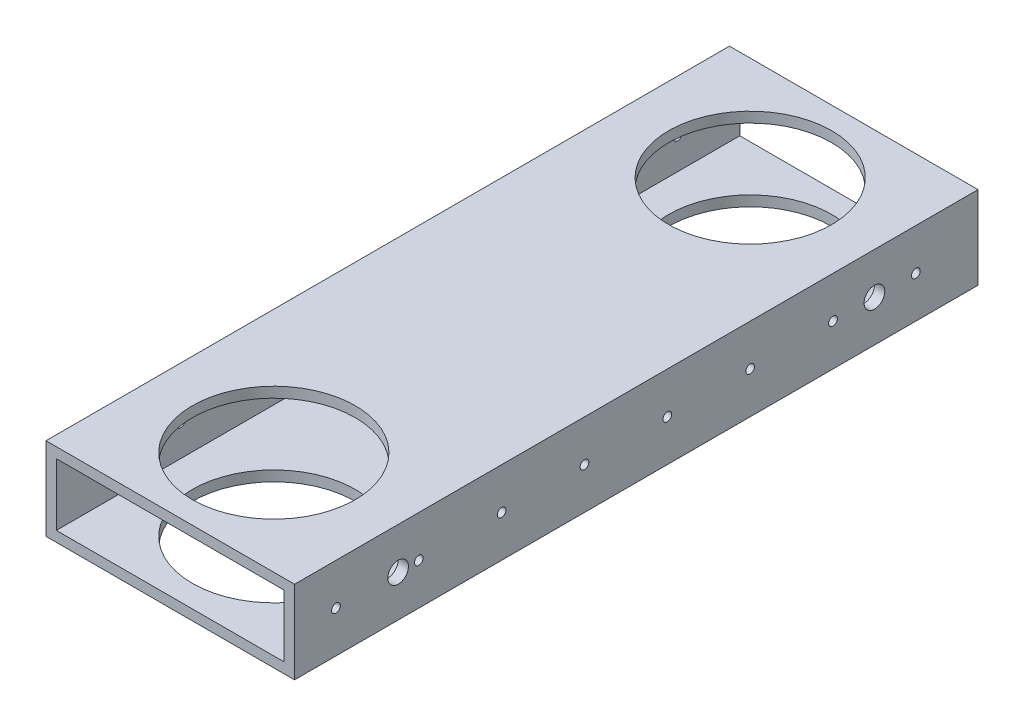
ISO-10303-21;
HEADER;
FILE_DESCRIPTION(('STEP AP214'),'2;1');
FILE_NAME('part.step','',(''),(''),'','','');
FILE_SCHEMA(('AUTOMOTIVE_DESIGN { 1 0 10303 214 1 1 1 1 }'));
ENDSEC;
DATA;
#1=APPLICATION_CONTEXT('core data for automotive mechanical design processes');
#2=APPLICATION_PROTOCOL_DEFINITION('international standard','automotive_design',2000,#1);
#3=PRODUCT_CONTEXT('',#1,'mechanical');
#4=PRODUCT('Part','Part','',(#3));
#5=PRODUCT_RELATED_PRODUCT_CATEGORY('part','',(#4));
#6=PRODUCT_DEFINITION_FORMATION('','',#4);
#7=PRODUCT_DEFINITION_CONTEXT('part definition',#1,'design');
#8=PRODUCT_DEFINITION('design','',#6,#7);
#9=PRODUCT_DEFINITION_SHAPE('','',#8);
#10=(LENGTH_UNIT() NAMED_UNIT(*) SI_UNIT(.MILLI.,.METRE.));
#11=(NAMED_UNIT(*) PLANE_ANGLE_UNIT() SI_UNIT($,.RADIAN.));
#12=(NAMED_UNIT(*) SI_UNIT($,.STERADIAN.) SOLID_ANGLE_UNIT());
#13=UNCERTAINTY_MEASURE_WITH_UNIT(LENGTH_MEASURE(1.E-05),#10,'distance_accuracy_value','');
#14=(GEOMETRIC_REPRESENTATION_CONTEXT(3) GLOBAL_UNCERTAINTY_ASSIGNED_CONTEXT((#13)) GLOBAL_UNIT_ASSIGNED_CONTEXT((#10,
#11,#12)) REPRESENTATION_CONTEXT('',''));
#15=CARTESIAN_POINT('',(0.,0.,0.));
#16=DIRECTION('',(0.,0.,1.));
#17=DIRECTION('',(1.,0.,0.));
#18=AXIS2_PLACEMENT_3D('',#15,#16,#17);
#19=CARTESIAN_POINT('',(0.,0.,209.55));
#20=DIRECTION('',(0.,0.,1.));
#21=DIRECTION('',(1.,0.,0.));
#22=AXIS2_PLACEMENT_3D('',#19,#20,#21);
#23=PLANE('',#22);
#24=DIRECTION('',(0.,1.,0.));
#25=VECTOR('',#24,1.);
#26=CARTESIAN_POINT('',(38.1,-12.7,209.55));
#27=LINE('',#26,#25);
#28=CARTESIAN_POINT('',(38.1,-12.7,209.55));
#29=VERTEX_POINT('',#28);
#30=CARTESIAN_POINT('',(38.1,12.7,209.55));
#31=VERTEX_POINT('',#30);
#32=EDGE_CURVE('E168',#29,#31,#27,.T.);
#33=ORIENTED_EDGE('',*,*,#32,.T.);
#34=DIRECTION('',(-1.,0.,0.));
#35=VECTOR('',#34,1.);
#36=CARTESIAN_POINT('',(-38.1,12.7,209.55));
#37=LINE('',#36,#35);
#38=CARTESIAN_POINT('',(-38.1,12.7,209.55));
#39=VERTEX_POINT('',#38);
#40=EDGE_CURVE('E171',#31,#39,#37,.T.);
#41=ORIENTED_EDGE('',*,*,#40,.T.);
#42=DIRECTION('',(0.,-1.,0.));
#43=VECTOR('',#42,1.);
#44=CARTESIAN_POINT('',(-38.1,-12.7,209.55));
#45=LINE('',#44,#43);
#46=CARTESIAN_POINT('',(-38.1,-12.7,209.55));
#47=VERTEX_POINT('',#46);
#48=EDGE_CURVE('E174',#39,#47,#45,.T.);
#49=ORIENTED_EDGE('',*,*,#48,.T.);
#50=DIRECTION('',(1.,0.,0.));
#51=VECTOR('',#50,1.);
#52=CARTESIAN_POINT('',(-38.1,-12.7,209.55));
#53=LINE('',#52,#51);
#54=EDGE_CURVE('E176',#47,#29,#53,.T.);
#55=ORIENTED_EDGE('',*,*,#54,.T.);
#56=EDGE_LOOP('',(#33,#41,#49,#55));
#57=FACE_BOUND('',#56,.T.);
#58=DIRECTION('',(-1.,0.,0.));
#59=VECTOR('',#58,1.);
#60=CARTESIAN_POINT('',(0.,9.525,209.55));
#61=LINE('',#60,#59);
#62=CARTESIAN_POINT('',(34.925,9.525,209.55));
#63=VERTEX_POINT('',#62);
#64=CARTESIAN_POINT('',(-34.925,9.525,209.55));
#65=VERTEX_POINT('',#64);
#66=EDGE_CURVE('E138',#63,#65,#61,.T.);
#67=ORIENTED_EDGE('',*,*,#66,.F.);
#68=DIRECTION('',(0.,1.,0.));
#69=VECTOR('',#68,1.);
#70=CARTESIAN_POINT('',(34.925,0.,209.55));
#71=LINE('',#70,#69);
#72=CARTESIAN_POINT('',(34.925,-9.525,209.55));
#73=VERTEX_POINT('',#72);
#74=EDGE_CURVE('E130',#73,#63,#71,.T.);
#75=ORIENTED_EDGE('',*,*,#74,.F.);
#76=DIRECTION('',(1.,0.,0.));
#77=VECTOR('',#76,1.);
#78=CARTESIAN_POINT('',(0.,-9.525,209.55));
#79=LINE('',#78,#77);
#80=CARTESIAN_POINT('',(-34.925,-9.525,209.55));
#81=VERTEX_POINT('',#80);
#82=EDGE_CURVE('E152',#81,#73,#79,.T.);
#83=ORIENTED_EDGE('',*,*,#82,.F.);
#84=DIRECTION('',(0.,-1.,0.));
#85=VECTOR('',#84,1.);
#86=CARTESIAN_POINT('',(-34.925,0.,209.55));
#87=LINE('',#86,#85);
#88=EDGE_CURVE('E150',#65,#81,#87,.T.);
#89=ORIENTED_EDGE('',*,*,#88,.F.);
#90=EDGE_LOOP('',(#67,#75,#83,#89));
#91=FACE_BOUND('',#90,.T.);
#92=ADVANCED_FACE('F63',(#57,#91),#23,.T.);
#93=CARTESIAN_POINT('',(0.,0.,0.));
#94=DIRECTION('',(0.,0.,1.));
#95=DIRECTION('',(1.,0.,0.));
#96=AXIS2_PLACEMENT_3D('',#93,#94,#95);
#97=PLANE('',#96);
#98=DIRECTION('',(0.,1.,0.));
#99=VECTOR('',#98,1.);
#100=CARTESIAN_POINT('',(38.1,-12.7,0.));
#101=LINE('',#100,#99);
#102=CARTESIAN_POINT('',(38.1,-12.7,0.));
#103=VERTEX_POINT('',#102);
#104=CARTESIAN_POINT('',(38.1,12.7,0.));
#105=VERTEX_POINT('',#104);
#106=EDGE_CURVE('E146',#103,#105,#101,.T.);
#107=ORIENTED_EDGE('',*,*,#106,.F.);
#108=DIRECTION('',(1.,0.,0.));
#109=VECTOR('',#108,1.);
#110=CARTESIAN_POINT('',(-38.1,-12.7,0.));
#111=LINE('',#110,#109);
#112=CARTESIAN_POINT('',(-38.1,-12.7,0.));
#113=VERTEX_POINT('',#112);
#114=EDGE_CURVE('E172',#113,#103,#111,.T.);
#115=ORIENTED_EDGE('',*,*,#114,.F.);
#116=DIRECTION('',(0.,-1.,0.));
#117=VECTOR('',#116,1.);
#118=CARTESIAN_POINT('',(-38.1,-12.7,0.));
#119=LINE('',#118,#117);
#120=CARTESIAN_POINT('',(-38.1,12.7,0.));
#121=VERTEX_POINT('',#120);
#122=EDGE_CURVE('E183',#121,#113,#119,.T.);
#123=ORIENTED_EDGE('',*,*,#122,.F.);
#124=DIRECTION('',(-1.,0.,0.));
#125=VECTOR('',#124,1.);
#126=CARTESIAN_POINT('',(-38.1,12.7,0.));
#127=LINE('',#126,#125);
#128=EDGE_CURVE('E181',#105,#121,#127,.T.);
#129=ORIENTED_EDGE('',*,*,#128,.F.);
#130=EDGE_LOOP('',(#107,#115,#123,#129));
#131=FACE_BOUND('',#130,.T.);
#132=DIRECTION('',(0.,1.,0.));
#133=VECTOR('',#132,1.);
#134=CARTESIAN_POINT('',(34.925,0.,0.));
#135=LINE('',#134,#133);
#136=CARTESIAN_POINT('',(34.925,-9.525,0.));
#137=VERTEX_POINT('',#136);
#138=CARTESIAN_POINT('',(34.925,9.525,0.));
#139=VERTEX_POINT('',#138);
#140=EDGE_CURVE('E88',#137,#139,#135,.T.);
#141=ORIENTED_EDGE('',*,*,#140,.T.);
#142=DIRECTION('',(-1.,0.,0.));
#143=VECTOR('',#142,1.);
#144=CARTESIAN_POINT('',(0.,9.525,0.));
#145=LINE('',#144,#143);
#146=CARTESIAN_POINT('',(-34.925,9.525,0.));
#147=VERTEX_POINT('',#146);
#148=EDGE_CURVE('E145',#139,#147,#145,.T.);
#149=ORIENTED_EDGE('',*,*,#148,.T.);
#150=DIRECTION('',(0.,-1.,0.));
#151=VECTOR('',#150,1.);
#152=CARTESIAN_POINT('',(-34.925,0.,0.));
#153=LINE('',#152,#151);
#154=CARTESIAN_POINT('',(-34.925,-9.525,0.));
#155=VERTEX_POINT('',#154);
#156=EDGE_CURVE('E160',#147,#155,#153,.T.);
#157=ORIENTED_EDGE('',*,*,#156,.T.);
#158=DIRECTION('',(1.,0.,0.));
#159=VECTOR('',#158,1.);
#160=CARTESIAN_POINT('',(0.,-9.525,0.));
#161=LINE('',#160,#159);
#162=EDGE_CURVE('E139',#155,#137,#161,.T.);
#163=ORIENTED_EDGE('',*,*,#162,.T.);
#164=EDGE_LOOP('',(#141,#149,#157,#163));
#165=FACE_BOUND('',#164,.T.);
#166=ADVANCED_FACE('F367',(#131,#165),#97,.F.);
#167=CARTESIAN_POINT('',(38.1,-12.7,209.55));
#168=DIRECTION('',(-1.,0.,0.));
#169=DIRECTION('',(0.,0.,1.));
#170=AXIS2_PLACEMENT_3D('',#167,#168,#169);
#171=PLANE('',#170);
#172=CARTESIAN_POINT('',(38.1,0.,31.75));
#173=DIRECTION('',(1.,0.,0.));
#174=DIRECTION('',(0.,0.,-1.));
#175=AXIS2_PLACEMENT_3D('',#172,#173,#174);
#176=CIRCLE('',#175,3.175);
#177=CARTESIAN_POINT('',(38.1,0.,28.575));
#178=VERTEX_POINT('',#177);
#179=EDGE_CURVE('E243',#178,#178,#176,.T.);
#180=ORIENTED_EDGE('',*,*,#179,.F.);
#181=EDGE_LOOP('',(#180));
#182=FACE_BOUND('',#181,.T.);
#183=CARTESIAN_POINT('',(38.1,0.,177.8));
#184=DIRECTION('',(1.,0.,0.));
#185=DIRECTION('',(0.,0.,1.));
#186=AXIS2_PLACEMENT_3D('',#183,#184,#185);
#187=CIRCLE('',#186,3.175);
#188=CARTESIAN_POINT('',(38.1,0.,180.975));
#189=VERTEX_POINT('',#188);
#190=EDGE_CURVE('E253',#189,#189,#187,.T.);
#191=ORIENTED_EDGE('',*,*,#190,.F.);
#192=EDGE_LOOP('',(#191));
#193=FACE_BOUND('',#192,.T.);
#194=CARTESIAN_POINT('',(38.1,0.,171.45));
#195=DIRECTION('',(1.,0.,0.));
#196=DIRECTION('',(0.,0.,-1.));
#197=AXIS2_PLACEMENT_3D('',#194,#195,#196);
#198=CIRCLE('',#197,1.33349999999998);
#199=CARTESIAN_POINT('',(38.1,0.,170.1165));
#200=VERTEX_POINT('',#199);
#201=EDGE_CURVE('E262',#200,#200,#198,.T.);
#202=ORIENTED_EDGE('',*,*,#201,.F.);
#203=EDGE_LOOP('',(#202));
#204=FACE_BOUND('',#203,.T.);
#205=CARTESIAN_POINT('',(38.1,0.,146.05));
#206=DIRECTION('',(1.,0.,0.));
#207=DIRECTION('',(0.,0.,-1.));
#208=AXIS2_PLACEMENT_3D('',#205,#206,#207);
#209=CIRCLE('',#208,1.33349999999998);
#210=CARTESIAN_POINT('',(38.1,0.,144.7165));
#211=VERTEX_POINT('',#210);
#212=EDGE_CURVE('E268',#211,#211,#209,.T.);
#213=ORIENTED_EDGE('',*,*,#212,.F.);
#214=EDGE_LOOP('',(#213));
#215=FACE_BOUND('',#214,.T.);
#216=CARTESIAN_POINT('',(38.1,0.,120.65));
#217=DIRECTION('',(1.,0.,0.));
#218=DIRECTION('',(0.,0.,-1.));
#219=AXIS2_PLACEMENT_3D('',#216,#217,#218);
#220=CIRCLE('',#219,1.33349999999998);
#221=CARTESIAN_POINT('',(38.1,0.,119.3165));
#222=VERTEX_POINT('',#221);
#223=EDGE_CURVE('E274',#222,#222,#220,.T.);
#224=ORIENTED_EDGE('',*,*,#223,.F.);
#225=EDGE_LOOP('',(#224));
#226=FACE_BOUND('',#225,.T.);
#227=CARTESIAN_POINT('',(38.1,0.,95.25));
#228=DIRECTION('',(1.,0.,0.));
#229=DIRECTION('',(0.,0.,-1.));
#230=AXIS2_PLACEMENT_3D('',#227,#228,#229);
#231=CIRCLE('',#230,1.33349999999998);
#232=CARTESIAN_POINT('',(38.1,0.,93.9165));
#233=VERTEX_POINT('',#232);
#234=EDGE_CURVE('E280',#233,#233,#231,.T.);
#235=ORIENTED_EDGE('',*,*,#234,.F.);
#236=EDGE_LOOP('',(#235));
#237=FACE_BOUND('',#236,.T.);
#238=CARTESIAN_POINT('',(38.1,0.,69.85));
#239=DIRECTION('',(1.,0.,0.));
#240=DIRECTION('',(0.,0.,-1.));
#241=AXIS2_PLACEMENT_3D('',#238,#239,#240);
#242=CIRCLE('',#241,1.33349999999998);
#243=CARTESIAN_POINT('',(38.1,0.,68.5165));
#244=VERTEX_POINT('',#243);
#245=EDGE_CURVE('E286',#244,#244,#242,.T.);
#246=ORIENTED_EDGE('',*,*,#245,.F.);
#247=EDGE_LOOP('',(#246));
#248=FACE_BOUND('',#247,.T.);
#249=CARTESIAN_POINT('',(38.1,0.,44.45));
#250=DIRECTION('',(1.,0.,0.));
#251=DIRECTION('',(0.,0.,-1.));
#252=AXIS2_PLACEMENT_3D('',#249,#250,#251);
#253=CIRCLE('',#252,1.33349999999998);
#254=CARTESIAN_POINT('',(38.1,0.,43.1165));
#255=VERTEX_POINT('',#254);
#256=EDGE_CURVE('E292',#255,#255,#253,.T.);
#257=ORIENTED_EDGE('',*,*,#256,.F.);
#258=EDGE_LOOP('',(#257));
#259=FACE_BOUND('',#258,.T.);
#260=CARTESIAN_POINT('',(38.1,0.,19.05));
#261=DIRECTION('',(1.,0.,0.));
#262=DIRECTION('',(0.,0.,-1.));
#263=AXIS2_PLACEMENT_3D('',#260,#261,#262);
#264=CIRCLE('',#263,1.33349999999998);
#265=CARTESIAN_POINT('',(38.1,0.,17.7165));
#266=VERTEX_POINT('',#265);
#267=EDGE_CURVE('E259',#266,#266,#264,.T.);
#268=ORIENTED_EDGE('',*,*,#267,.F.);
#269=EDGE_LOOP('',(#268));
#270=FACE_BOUND('',#269,.T.);
#271=CARTESIAN_POINT('',(38.1,0.,196.85));
#272=DIRECTION('',(1.,0.,0.));
#273=DIRECTION('',(0.,0.,-1.));
#274=AXIS2_PLACEMENT_3D('',#271,#272,#273);
#275=CIRCLE('',#274,1.33349999999998);
#276=CARTESIAN_POINT('',(38.1,0.,195.5165));
#277=VERTEX_POINT('',#276);
#278=EDGE_CURVE('E314',#277,#277,#275,.T.);
#279=ORIENTED_EDGE('',*,*,#278,.F.);
#280=EDGE_LOOP('',(#279));
#281=FACE_BOUND('',#280,.T.);
#282=ORIENTED_EDGE('',*,*,#106,.T.);
#283=DIRECTION('',(0.,0.,-1.));
#284=VECTOR('',#283,1.);
#285=CARTESIAN_POINT('',(38.1,12.7,209.55));
#286=LINE('',#285,#284);
#287=EDGE_CURVE('E12',#31,#105,#286,.T.);
#288=ORIENTED_EDGE('',*,*,#287,.F.);
#289=ORIENTED_EDGE('',*,*,#32,.F.);
#290=DIRECTION('',(0.,0.,-1.));
#291=VECTOR('',#290,1.);
#292=CARTESIAN_POINT('',(38.1,-12.7,209.55));
#293=LINE('',#292,#291);
#294=EDGE_CURVE('E178',#29,#103,#293,.T.);
#295=ORIENTED_EDGE('',*,*,#294,.T.);
#296=EDGE_LOOP('',(#282,#288,#289,#295));
#297=FACE_BOUND('',#296,.T.);
#298=ADVANCED_FACE('F65',(#182,#193,#204,#215,#226,#237,#248,#259,#270,#281,#297),#171,.F.);
#299=CARTESIAN_POINT('',(-38.1,12.7,209.55));
#300=DIRECTION('',(0.,-1.,0.));
#301=DIRECTION('',(0.,0.,-1.));
#302=AXIS2_PLACEMENT_3D('',#299,#300,#301);
#303=PLANE('',#302);
#304=CARTESIAN_POINT('',(0.,12.7,177.8));
#305=DIRECTION('',(0.,1.,0.));
#306=DIRECTION('',(0.,0.,1.));
#307=AXIS2_PLACEMENT_3D('',#304,#305,#306);
#308=CIRCLE('',#307,24.97201);
#309=CARTESIAN_POINT('',(0.,12.7,202.77201));
#310=VERTEX_POINT('',#309);
#311=EDGE_CURVE('E324',#310,#310,#308,.T.);
#312=ORIENTED_EDGE('',*,*,#311,.F.);
#313=EDGE_LOOP('',(#312));
#314=FACE_BOUND('',#313,.T.);
#315=CARTESIAN_POINT('',(0.,12.7,31.75));
#316=DIRECTION('',(0.,1.,0.));
#317=DIRECTION('',(0.,0.,-1.));
#318=AXIS2_PLACEMENT_3D('',#315,#316,#317);
#319=CIRCLE('',#318,24.97201);
#320=CARTESIAN_POINT('',(0.,12.7,6.77799));
#321=VERTEX_POINT('',#320);
#322=EDGE_CURVE('E321',#321,#321,#319,.T.);
#323=ORIENTED_EDGE('',*,*,#322,.F.);
#324=EDGE_LOOP('',(#323));
#325=FACE_BOUND('',#324,.T.);
#326=ORIENTED_EDGE('',*,*,#128,.T.);
#327=DIRECTION('',(0.,0.,-1.));
#328=VECTOR('',#327,1.);
#329=CARTESIAN_POINT('',(-38.1,12.7,209.55));
#330=LINE('',#329,#328);
#331=EDGE_CURVE('E72',#39,#121,#330,.T.);
#332=ORIENTED_EDGE('',*,*,#331,.F.);
#333=ORIENTED_EDGE('',*,*,#40,.F.);
#334=ORIENTED_EDGE('',*,*,#287,.T.);
#335=EDGE_LOOP('',(#326,#332,#333,#334));
#336=FACE_BOUND('',#335,.T.);
#337=ADVANCED_FACE('F353',(#314,#325,#336),#303,.F.);
#338=CARTESIAN_POINT('',(-38.1,-12.7,209.55));
#339=DIRECTION('',(1.,0.,0.));
#340=DIRECTION('',(0.,0.,-1.));
#341=AXIS2_PLACEMENT_3D('',#338,#339,#340);
#342=PLANE('',#341);
#343=CARTESIAN_POINT('',(-38.1,0.,31.75));
#344=DIRECTION('',(1.,0.,0.));
#345=DIRECTION('',(0.,0.,-1.));
#346=AXIS2_PLACEMENT_3D('',#343,#344,#345);
#347=CIRCLE('',#346,3.175);
#348=CARTESIAN_POINT('',(-38.1,0.,28.575));
#349=VERTEX_POINT('',#348);
#350=EDGE_CURVE('E237',#349,#349,#347,.T.);
#351=ORIENTED_EDGE('',*,*,#350,.T.);
#352=EDGE_LOOP('',(#351));
#353=FACE_BOUND('',#352,.T.);
#354=CARTESIAN_POINT('',(-38.1,0.,177.8));
#355=DIRECTION('',(1.,0.,0.));
#356=DIRECTION('',(0.,0.,1.));
#357=AXIS2_PLACEMENT_3D('',#354,#355,#356);
#358=CIRCLE('',#357,3.175);
#359=CARTESIAN_POINT('',(-38.1,0.,180.975));
#360=VERTEX_POINT('',#359);
#361=EDGE_CURVE('E248',#360,#360,#358,.T.);
#362=ORIENTED_EDGE('',*,*,#361,.T.);
#363=EDGE_LOOP('',(#362));
#364=FACE_BOUND('',#363,.T.);
#365=CARTESIAN_POINT('',(-38.1,0.,171.45));
#366=DIRECTION('',(1.,0.,0.));
#367=DIRECTION('',(0.,0.,-1.));
#368=AXIS2_PLACEMENT_3D('',#365,#366,#367);
#369=CIRCLE('',#368,1.33349999999998);
#370=CARTESIAN_POINT('',(-38.1,0.,170.1165));
#371=VERTEX_POINT('',#370);
#372=EDGE_CURVE('E210',#371,#371,#369,.T.);
#373=ORIENTED_EDGE('',*,*,#372,.T.);
#374=EDGE_LOOP('',(#373));
#375=FACE_BOUND('',#374,.T.);
#376=CARTESIAN_POINT('',(-38.1,0.,146.05));
#377=DIRECTION('',(1.,0.,0.));
#378=DIRECTION('',(0.,0.,-1.));
#379=AXIS2_PLACEMENT_3D('',#376,#377,#378);
#380=CIRCLE('',#379,1.33349999999998);
#381=CARTESIAN_POINT('',(-38.1,0.,144.7165));
#382=VERTEX_POINT('',#381);
#383=EDGE_CURVE('E265',#382,#382,#380,.T.);
#384=ORIENTED_EDGE('',*,*,#383,.T.);
#385=EDGE_LOOP('',(#384));
#386=FACE_BOUND('',#385,.T.);
#387=CARTESIAN_POINT('',(-38.1,0.,120.65));
#388=DIRECTION('',(1.,0.,0.));
#389=DIRECTION('',(0.,0.,-1.));
#390=AXIS2_PLACEMENT_3D('',#387,#388,#389);
#391=CIRCLE('',#390,1.33349999999998);
#392=CARTESIAN_POINT('',(-38.1,0.,119.3165));
#393=VERTEX_POINT('',#392);
#394=EDGE_CURVE('E271',#393,#393,#391,.T.);
#395=ORIENTED_EDGE('',*,*,#394,.T.);
#396=EDGE_LOOP('',(#395));
#397=FACE_BOUND('',#396,.T.);
#398=CARTESIAN_POINT('',(-38.1,0.,95.25));
#399=DIRECTION('',(1.,0.,0.));
#400=DIRECTION('',(0.,0.,-1.));
#401=AXIS2_PLACEMENT_3D('',#398,#399,#400);
#402=CIRCLE('',#401,1.33349999999998);
#403=CARTESIAN_POINT('',(-38.1,0.,93.9165));
#404=VERTEX_POINT('',#403);
#405=EDGE_CURVE('E277',#404,#404,#402,.T.);
#406=ORIENTED_EDGE('',*,*,#405,.T.);
#407=EDGE_LOOP('',(#406));
#408=FACE_BOUND('',#407,.T.);
#409=CARTESIAN_POINT('',(-38.1,0.,69.85));
#410=DIRECTION('',(1.,0.,0.));
#411=DIRECTION('',(0.,0.,-1.));
#412=AXIS2_PLACEMENT_3D('',#409,#410,#411);
#413=CIRCLE('',#412,1.33349999999998);
#414=CARTESIAN_POINT('',(-38.1,0.,68.5165));
#415=VERTEX_POINT('',#414);
#416=EDGE_CURVE('E283',#415,#415,#413,.T.);
#417=ORIENTED_EDGE('',*,*,#416,.T.);
#418=EDGE_LOOP('',(#417));
#419=FACE_BOUND('',#418,.T.);
#420=CARTESIAN_POINT('',(-38.1,0.,44.45));
#421=DIRECTION('',(1.,0.,0.));
#422=DIRECTION('',(0.,0.,-1.));
#423=AXIS2_PLACEMENT_3D('',#420,#421,#422);
#424=CIRCLE('',#423,1.33349999999998);
#425=CARTESIAN_POINT('',(-38.1,0.,43.1165));
#426=VERTEX_POINT('',#425);
#427=EDGE_CURVE('E289',#426,#426,#424,.T.);
#428=ORIENTED_EDGE('',*,*,#427,.T.);
#429=EDGE_LOOP('',(#428));
#430=FACE_BOUND('',#429,.T.);
#431=CARTESIAN_POINT('',(-38.1,0.,19.05));
#432=DIRECTION('',(1.,0.,0.));
#433=DIRECTION('',(0.,0.,-1.));
#434=AXIS2_PLACEMENT_3D('',#431,#432,#433);
#435=CIRCLE('',#434,1.33349999999998);
#436=CARTESIAN_POINT('',(-38.1,0.,17.7165));
#437=VERTEX_POINT('',#436);
#438=EDGE_CURVE('E295',#437,#437,#435,.T.);
#439=ORIENTED_EDGE('',*,*,#438,.T.);
#440=EDGE_LOOP('',(#439));
#441=FACE_BOUND('',#440,.T.);
#442=CARTESIAN_POINT('',(-38.1,0.,196.85));
#443=DIRECTION('',(1.,0.,0.));
#444=DIRECTION('',(0.,0.,-1.));
#445=AXIS2_PLACEMENT_3D('',#442,#443,#444);
#446=CIRCLE('',#445,1.33349999999998);
#447=CARTESIAN_POINT('',(-38.1,0.,195.5165));
#448=VERTEX_POINT('',#447);
#449=EDGE_CURVE('E205',#448,#448,#446,.T.);
#450=ORIENTED_EDGE('',*,*,#449,.T.);
#451=EDGE_LOOP('',(#450));
#452=FACE_BOUND('',#451,.T.);
#453=ORIENTED_EDGE('',*,*,#122,.T.);
#454=DIRECTION('',(0.,0.,-1.));
#455=VECTOR('',#454,1.);
#456=CARTESIAN_POINT('',(-38.1,-12.7,209.55));
#457=LINE('',#456,#455);
#458=EDGE_CURVE('E188',#47,#113,#457,.T.);
#459=ORIENTED_EDGE('',*,*,#458,.F.);
#460=ORIENTED_EDGE('',*,*,#48,.F.);
#461=ORIENTED_EDGE('',*,*,#331,.T.);
#462=EDGE_LOOP('',(#453,#459,#460,#461));
#463=FACE_BOUND('',#462,.T.);
#464=ADVANCED_FACE('F356',(#353,#364,#375,#386,#397,#408,#419,#430,#441,#452,#463),#342,.F.);
#465=CARTESIAN_POINT('',(-38.1,-12.7,209.55));
#466=DIRECTION('',(0.,1.,0.));
#467=DIRECTION('',(0.,0.,1.));
#468=AXIS2_PLACEMENT_3D('',#465,#466,#467);
#469=PLANE('',#468);
#470=CARTESIAN_POINT('',(0.,-12.7,177.8));
#471=DIRECTION('',(0.,1.,0.));
#472=DIRECTION('',(0.,0.,1.));
#473=AXIS2_PLACEMENT_3D('',#470,#471,#472);
#474=CIRCLE('',#473,24.97201);
#475=CARTESIAN_POINT('',(0.,-12.7,202.77201));
#476=VERTEX_POINT('',#475);
#477=EDGE_CURVE('E197',#476,#476,#474,.T.);
#478=ORIENTED_EDGE('',*,*,#477,.T.);
#479=EDGE_LOOP('',(#478));
#480=FACE_BOUND('',#479,.T.);
#481=CARTESIAN_POINT('',(0.,-12.7,31.75));
#482=DIRECTION('',(0.,1.,0.));
#483=DIRECTION('',(0.,0.,-1.));
#484=AXIS2_PLACEMENT_3D('',#481,#482,#483);
#485=CIRCLE('',#484,24.97201);
#486=CARTESIAN_POINT('',(0.,-12.7,6.77799));
#487=VERTEX_POINT('',#486);
#488=EDGE_CURVE('E327',#487,#487,#485,.T.);
#489=ORIENTED_EDGE('',*,*,#488,.T.);
#490=EDGE_LOOP('',(#489));
#491=FACE_BOUND('',#490,.T.);
#492=ORIENTED_EDGE('',*,*,#114,.T.);
#493=ORIENTED_EDGE('',*,*,#294,.F.);
#494=ORIENTED_EDGE('',*,*,#54,.F.);
#495=ORIENTED_EDGE('',*,*,#458,.T.);
#496=EDGE_LOOP('',(#492,#493,#494,#495));
#497=FACE_BOUND('',#496,.T.);
#498=ADVANCED_FACE('F371',(#480,#491,#497),#469,.F.);
#499=CARTESIAN_POINT('',(34.925,0.,209.55));
#500=DIRECTION('',(-1.,0.,0.));
#501=DIRECTION('',(0.,0.,1.));
#502=AXIS2_PLACEMENT_3D('',#499,#500,#501);
#503=PLANE('',#502);
#504=CARTESIAN_POINT('',(34.925,0.,31.75));
#505=DIRECTION('',(-1.,0.,0.));
#506=DIRECTION('',(0.,0.,1.));
#507=AXIS2_PLACEMENT_3D('',#504,#505,#506);
#508=CIRCLE('',#507,3.175);
#509=CARTESIAN_POINT('',(34.925,0.,34.925));
#510=VERTEX_POINT('',#509);
#511=EDGE_CURVE('E256',#510,#510,#508,.T.);
#512=ORIENTED_EDGE('',*,*,#511,.F.);
#513=EDGE_LOOP('',(#512));
#514=FACE_BOUND('',#513,.T.);
#515=CARTESIAN_POINT('',(34.925,0.,177.8));
#516=DIRECTION('',(-1.,0.,0.));
#517=DIRECTION('',(0.,0.,1.));
#518=AXIS2_PLACEMENT_3D('',#515,#516,#517);
#519=CIRCLE('',#518,3.175);
#520=CARTESIAN_POINT('',(34.925,0.,180.975));
#521=VERTEX_POINT('',#520);
#522=EDGE_CURVE('E236',#521,#521,#519,.T.);
#523=ORIENTED_EDGE('',*,*,#522,.F.);
#524=EDGE_LOOP('',(#523));
#525=FACE_BOUND('',#524,.T.);
#526=CARTESIAN_POINT('',(34.925,0.,171.45));
#527=DIRECTION('',(-1.,0.,0.));
#528=DIRECTION('',(0.,0.,1.));
#529=AXIS2_PLACEMENT_3D('',#526,#527,#528);
#530=CIRCLE('',#529,1.33349999999998);
#531=CARTESIAN_POINT('',(34.925,0.,172.7835));
#532=VERTEX_POINT('',#531);
#533=EDGE_CURVE('E233',#532,#532,#530,.T.);
#534=ORIENTED_EDGE('',*,*,#533,.F.);
#535=EDGE_LOOP('',(#534));
#536=FACE_BOUND('',#535,.T.);
#537=CARTESIAN_POINT('',(34.925,0.,146.05));
#538=DIRECTION('',(-1.,0.,0.));
#539=DIRECTION('',(0.,0.,1.));
#540=AXIS2_PLACEMENT_3D('',#537,#538,#539);
#541=CIRCLE('',#540,1.33349999999998);
#542=CARTESIAN_POINT('',(34.925,0.,147.3835));
#543=VERTEX_POINT('',#542);
#544=EDGE_CURVE('E230',#543,#543,#541,.T.);
#545=ORIENTED_EDGE('',*,*,#544,.F.);
#546=EDGE_LOOP('',(#545));
#547=FACE_BOUND('',#546,.T.);
#548=CARTESIAN_POINT('',(34.925,0.,120.65));
#549=DIRECTION('',(-1.,0.,0.));
#550=DIRECTION('',(0.,0.,1.));
#551=AXIS2_PLACEMENT_3D('',#548,#549,#550);
#552=CIRCLE('',#551,1.33349999999998);
#553=CARTESIAN_POINT('',(34.925,0.,121.9835));
#554=VERTEX_POINT('',#553);
#555=EDGE_CURVE('E226',#554,#554,#552,.T.);
#556=ORIENTED_EDGE('',*,*,#555,.F.);
#557=EDGE_LOOP('',(#556));
#558=FACE_BOUND('',#557,.T.);
#559=CARTESIAN_POINT('',(34.925,0.,95.25));
#560=DIRECTION('',(-1.,0.,0.));
#561=DIRECTION('',(0.,0.,1.));
#562=AXIS2_PLACEMENT_3D('',#559,#560,#561);
#563=CIRCLE('',#562,1.33349999999998);
#564=CARTESIAN_POINT('',(34.925,0.,96.5835));
#565=VERTEX_POINT('',#564);
#566=EDGE_CURVE('E222',#565,#565,#563,.T.);
#567=ORIENTED_EDGE('',*,*,#566,.F.);
#568=EDGE_LOOP('',(#567));
#569=FACE_BOUND('',#568,.T.);
#570=CARTESIAN_POINT('',(34.925,0.,69.85));
#571=DIRECTION('',(-1.,0.,0.));
#572=DIRECTION('',(0.,0.,1.));
#573=AXIS2_PLACEMENT_3D('',#570,#571,#572);
#574=CIRCLE('',#573,1.33349999999998);
#575=CARTESIAN_POINT('',(34.925,0.,71.1835));
#576=VERTEX_POINT('',#575);
#577=EDGE_CURVE('E218',#576,#576,#574,.T.);
#578=ORIENTED_EDGE('',*,*,#577,.F.);
#579=EDGE_LOOP('',(#578));
#580=FACE_BOUND('',#579,.T.);
#581=CARTESIAN_POINT('',(34.925,0.,44.45));
#582=DIRECTION('',(-1.,0.,0.));
#583=DIRECTION('',(0.,0.,1.));
#584=AXIS2_PLACEMENT_3D('',#581,#582,#583);
#585=CIRCLE('',#584,1.33349999999998);
#586=CARTESIAN_POINT('',(34.925,0.,45.7835));
#587=VERTEX_POINT('',#586);
#588=EDGE_CURVE('E214',#587,#587,#585,.T.);
#589=ORIENTED_EDGE('',*,*,#588,.F.);
#590=EDGE_LOOP('',(#589));
#591=FACE_BOUND('',#590,.T.);
#592=CARTESIAN_POINT('',(34.925,0.,19.05));
#593=DIRECTION('',(-1.,0.,0.));
#594=DIRECTION('',(0.,0.,1.));
#595=AXIS2_PLACEMENT_3D('',#592,#593,#594);
#596=CIRCLE('',#595,1.33349999999998);
#597=CARTESIAN_POINT('',(34.925,0.,20.3835));
#598=VERTEX_POINT('',#597);
#599=EDGE_CURVE('E209',#598,#598,#596,.T.);
#600=ORIENTED_EDGE('',*,*,#599,.F.);
#601=EDGE_LOOP('',(#600));
#602=FACE_BOUND('',#601,.T.);
#603=CARTESIAN_POINT('',(34.925,0.,196.85));
#604=DIRECTION('',(-1.,0.,0.));
#605=DIRECTION('',(0.,0.,1.));
#606=AXIS2_PLACEMENT_3D('',#603,#604,#605);
#607=CIRCLE('',#606,1.33349999999998);
#608=CARTESIAN_POINT('',(34.925,0.,198.1835));
#609=VERTEX_POINT('',#608);
#610=EDGE_CURVE('E204',#609,#609,#607,.T.);
#611=ORIENTED_EDGE('',*,*,#610,.F.);
#612=EDGE_LOOP('',(#611));
#613=FACE_BOUND('',#612,.T.);
#614=ORIENTED_EDGE('',*,*,#140,.F.);
#615=DIRECTION('',(0.,0.,-1.));
#616=VECTOR('',#615,1.);
#617=CARTESIAN_POINT('',(34.925,-9.525,209.55));
#618=LINE('',#617,#616);
#619=EDGE_CURVE('E134',#73,#137,#618,.T.);
#620=ORIENTED_EDGE('',*,*,#619,.F.);
#621=ORIENTED_EDGE('',*,*,#74,.T.);
#622=DIRECTION('',(0.,0.,-1.));
#623=VECTOR('',#622,1.);
#624=CARTESIAN_POINT('',(34.925,9.525,209.55));
#625=LINE('',#624,#623);
#626=EDGE_CURVE('E133',#63,#139,#625,.T.);
#627=ORIENTED_EDGE('',*,*,#626,.T.);
#628=EDGE_LOOP('',(#614,#620,#621,#627));
#629=FACE_BOUND('',#628,.T.);
#630=ADVANCED_FACE('F132',(#514,#525,#536,#547,#558,#569,#580,#591,#602,#613,#629),#503,.T.);
#631=CARTESIAN_POINT('',(0.,9.525,209.55));
#632=DIRECTION('',(0.,-1.,0.));
#633=DIRECTION('',(0.,0.,-1.));
#634=AXIS2_PLACEMENT_3D('',#631,#632,#633);
#635=PLANE('',#634);
#636=CARTESIAN_POINT('',(0.,9.525,177.8));
#637=DIRECTION('',(0.,-1.,0.));
#638=DIRECTION('',(0.,0.,-1.));
#639=AXIS2_PLACEMENT_3D('',#636,#637,#638);
#640=CIRCLE('',#639,24.97201);
#641=CARTESIAN_POINT('',(0.,9.525,152.82799));
#642=VERTEX_POINT('',#641);
#643=EDGE_CURVE('E158',#642,#642,#640,.T.);
#644=ORIENTED_EDGE('',*,*,#643,.F.);
#645=EDGE_LOOP('',(#644));
#646=FACE_BOUND('',#645,.T.);
#647=CARTESIAN_POINT('',(0.,9.525,31.75));
#648=DIRECTION('',(0.,-1.,0.));
#649=DIRECTION('',(0.,0.,-1.));
#650=AXIS2_PLACEMENT_3D('',#647,#648,#649);
#651=CIRCLE('',#650,24.97201);
#652=CARTESIAN_POINT('',(0.,9.525,6.77799));
#653=VERTEX_POINT('',#652);
#654=EDGE_CURVE('E196',#653,#653,#651,.T.);
#655=ORIENTED_EDGE('',*,*,#654,.F.);
#656=EDGE_LOOP('',(#655));
#657=FACE_BOUND('',#656,.T.);
#658=ORIENTED_EDGE('',*,*,#148,.F.);
#659=ORIENTED_EDGE('',*,*,#626,.F.);
#660=ORIENTED_EDGE('',*,*,#66,.T.);
#661=DIRECTION('',(0.,0.,-1.));
#662=VECTOR('',#661,1.);
#663=CARTESIAN_POINT('',(-34.925,9.525,209.55));
#664=LINE('',#663,#662);
#665=EDGE_CURVE('E147',#65,#147,#664,.T.);
#666=ORIENTED_EDGE('',*,*,#665,.T.);
#667=EDGE_LOOP('',(#658,#659,#660,#666));
#668=FACE_BOUND('',#667,.T.);
#669=ADVANCED_FACE('F142',(#646,#657,#668),#635,.T.);
#670=CARTESIAN_POINT('',(-34.925,0.,209.55));
#671=DIRECTION('',(1.,0.,0.));
#672=DIRECTION('',(0.,0.,-1.));
#673=AXIS2_PLACEMENT_3D('',#670,#671,#672);
#674=PLANE('',#673);
#675=CARTESIAN_POINT('',(-34.925,0.,31.75));
#676=DIRECTION('',(1.,0.,0.));
#677=DIRECTION('',(0.,0.,-1.));
#678=AXIS2_PLACEMENT_3D('',#675,#676,#677);
#679=CIRCLE('',#678,3.175);
#680=CARTESIAN_POINT('',(-34.925,0.,28.575));
#681=VERTEX_POINT('',#680);
#682=EDGE_CURVE('E67',#681,#681,#679,.T.);
#683=ORIENTED_EDGE('',*,*,#682,.F.);
#684=EDGE_LOOP('',(#683));
#685=FACE_BOUND('',#684,.T.);
#686=CARTESIAN_POINT('',(-34.925,0.,177.8));
#687=DIRECTION('',(1.,0.,0.));
#688=DIRECTION('',(0.,0.,-1.));
#689=AXIS2_PLACEMENT_3D('',#686,#687,#688);
#690=CIRCLE('',#689,3.175);
#691=CARTESIAN_POINT('',(-34.925,0.,174.625));
#692=VERTEX_POINT('',#691);
#693=EDGE_CURVE('E234',#692,#692,#690,.T.);
#694=ORIENTED_EDGE('',*,*,#693,.F.);
#695=EDGE_LOOP('',(#694));
#696=FACE_BOUND('',#695,.T.);
#697=CARTESIAN_POINT('',(-34.925,0.,171.45));
#698=DIRECTION('',(1.,0.,0.));
#699=DIRECTION('',(0.,0.,-1.));
#700=AXIS2_PLACEMENT_3D('',#697,#698,#699);
#701=CIRCLE('',#700,1.33349999999998);
#702=CARTESIAN_POINT('',(-34.925,0.,170.1165));
#703=VERTEX_POINT('',#702);
#704=EDGE_CURVE('E231',#703,#703,#701,.T.);
#705=ORIENTED_EDGE('',*,*,#704,.F.);
#706=EDGE_LOOP('',(#705));
#707=FACE_BOUND('',#706,.T.);
#708=CARTESIAN_POINT('',(-34.925,0.,146.05));
#709=DIRECTION('',(1.,0.,0.));
#710=DIRECTION('',(0.,0.,-1.));
#711=AXIS2_PLACEMENT_3D('',#708,#709,#710);
#712=CIRCLE('',#711,1.33349999999998);
#713=CARTESIAN_POINT('',(-34.925,0.,144.7165));
#714=VERTEX_POINT('',#713);
#715=EDGE_CURVE('E227',#714,#714,#712,.T.);
#716=ORIENTED_EDGE('',*,*,#715,.F.);
#717=EDGE_LOOP('',(#716));
#718=FACE_BOUND('',#717,.T.);
#719=CARTESIAN_POINT('',(-34.925,0.,120.65));
#720=DIRECTION('',(1.,0.,0.));
#721=DIRECTION('',(0.,0.,-1.));
#722=AXIS2_PLACEMENT_3D('',#719,#720,#721);
#723=CIRCLE('',#722,1.33349999999998);
#724=CARTESIAN_POINT('',(-34.925,0.,119.3165));
#725=VERTEX_POINT('',#724);
#726=EDGE_CURVE('E223',#725,#725,#723,.T.);
#727=ORIENTED_EDGE('',*,*,#726,.F.);
#728=EDGE_LOOP('',(#727));
#729=FACE_BOUND('',#728,.T.);
#730=CARTESIAN_POINT('',(-34.925,0.,95.25));
#731=DIRECTION('',(1.,0.,0.));
#732=DIRECTION('',(0.,0.,-1.));
#733=AXIS2_PLACEMENT_3D('',#730,#731,#732);
#734=CIRCLE('',#733,1.33349999999998);
#735=CARTESIAN_POINT('',(-34.925,0.,93.9165));
#736=VERTEX_POINT('',#735);
#737=EDGE_CURVE('E219',#736,#736,#734,.T.);
#738=ORIENTED_EDGE('',*,*,#737,.F.);
#739=EDGE_LOOP('',(#738));
#740=FACE_BOUND('',#739,.T.);
#741=CARTESIAN_POINT('',(-34.925,0.,69.85));
#742=DIRECTION('',(1.,0.,0.));
#743=DIRECTION('',(0.,0.,-1.));
#744=AXIS2_PLACEMENT_3D('',#741,#742,#743);
#745=CIRCLE('',#744,1.33349999999998);
#746=CARTESIAN_POINT('',(-34.925,0.,68.5165));
#747=VERTEX_POINT('',#746);
#748=EDGE_CURVE('E215',#747,#747,#745,.T.);
#749=ORIENTED_EDGE('',*,*,#748,.F.);
#750=EDGE_LOOP('',(#749));
#751=FACE_BOUND('',#750,.T.);
#752=CARTESIAN_POINT('',(-34.925,0.,44.45));
#753=DIRECTION('',(1.,0.,0.));
#754=DIRECTION('',(0.,0.,-1.));
#755=AXIS2_PLACEMENT_3D('',#752,#753,#754);
#756=CIRCLE('',#755,1.33349999999998);
#757=CARTESIAN_POINT('',(-34.925,0.,43.1165));
#758=VERTEX_POINT('',#757);
#759=EDGE_CURVE('E211',#758,#758,#756,.T.);
#760=ORIENTED_EDGE('',*,*,#759,.F.);
#761=EDGE_LOOP('',(#760));
#762=FACE_BOUND('',#761,.T.);
#763=CARTESIAN_POINT('',(-34.925,0.,19.05));
#764=DIRECTION('',(1.,0.,0.));
#765=DIRECTION('',(0.,0.,-1.));
#766=AXIS2_PLACEMENT_3D('',#763,#764,#765);
#767=CIRCLE('',#766,1.33349999999998);
#768=CARTESIAN_POINT('',(-34.925,0.,17.7165));
#769=VERTEX_POINT('',#768);
#770=EDGE_CURVE('E206',#769,#769,#767,.T.);
#771=ORIENTED_EDGE('',*,*,#770,.F.);
#772=EDGE_LOOP('',(#771));
#773=FACE_BOUND('',#772,.T.);
#774=CARTESIAN_POINT('',(-34.925,0.,196.85));
#775=DIRECTION('',(1.,0.,0.));
#776=DIRECTION('',(0.,0.,-1.));
#777=AXIS2_PLACEMENT_3D('',#774,#775,#776);
#778=CIRCLE('',#777,1.33349999999998);
#779=CARTESIAN_POINT('',(-34.925,0.,195.5165));
#780=VERTEX_POINT('',#779);
#781=EDGE_CURVE('E201',#780,#780,#778,.T.);
#782=ORIENTED_EDGE('',*,*,#781,.F.);
#783=EDGE_LOOP('',(#782));
#784=FACE_BOUND('',#783,.T.);
#785=ORIENTED_EDGE('',*,*,#156,.F.);
#786=ORIENTED_EDGE('',*,*,#665,.F.);
#787=ORIENTED_EDGE('',*,*,#88,.T.);
#788=DIRECTION('',(0.,0.,-1.));
#789=VECTOR('',#788,1.);
#790=CARTESIAN_POINT('',(-34.925,-9.525,209.55));
#791=LINE('',#790,#789);
#792=EDGE_CURVE('E80',#81,#155,#791,.T.);
#793=ORIENTED_EDGE('',*,*,#792,.T.);
#794=EDGE_LOOP('',(#785,#786,#787,#793));
#795=FACE_BOUND('',#794,.T.);
#796=ADVANCED_FACE('F341',(#685,#696,#707,#718,#729,#740,#751,#762,#773,#784,#795),#674,.T.);
#797=CARTESIAN_POINT('',(0.,-9.525,209.55));
#798=DIRECTION('',(0.,1.,0.));
#799=DIRECTION('',(0.,0.,1.));
#800=AXIS2_PLACEMENT_3D('',#797,#798,#799);
#801=PLANE('',#800);
#802=CARTESIAN_POINT('',(0.,-9.525,177.8));
#803=DIRECTION('',(0.,1.,0.));
#804=DIRECTION('',(0.,0.,1.));
#805=AXIS2_PLACEMENT_3D('',#802,#803,#804);
#806=CIRCLE('',#805,24.97201);
#807=CARTESIAN_POINT('',(0.,-9.525,202.77201));
#808=VERTEX_POINT('',#807);
#809=EDGE_CURVE('E198',#808,#808,#806,.T.);
#810=ORIENTED_EDGE('',*,*,#809,.F.);
#811=EDGE_LOOP('',(#810));
#812=FACE_BOUND('',#811,.T.);
#813=CARTESIAN_POINT('',(0.,-9.525,31.75));
#814=DIRECTION('',(0.,1.,0.));
#815=DIRECTION('',(0.,0.,1.));
#816=AXIS2_PLACEMENT_3D('',#813,#814,#815);
#817=CIRCLE('',#816,24.97201);
#818=CARTESIAN_POINT('',(0.,-9.525,56.72201));
#819=VERTEX_POINT('',#818);
#820=EDGE_CURVE('E193',#819,#819,#817,.T.);
#821=ORIENTED_EDGE('',*,*,#820,.F.);
#822=EDGE_LOOP('',(#821));
#823=FACE_BOUND('',#822,.T.);
#824=ORIENTED_EDGE('',*,*,#162,.F.);
#825=ORIENTED_EDGE('',*,*,#792,.F.);
#826=ORIENTED_EDGE('',*,*,#82,.T.);
#827=ORIENTED_EDGE('',*,*,#619,.T.);
#828=EDGE_LOOP('',(#824,#825,#826,#827));
#829=FACE_BOUND('',#828,.T.);
#830=ADVANCED_FACE('F427',(#812,#823,#829),#801,.T.);
#831=CARTESIAN_POINT('',(0.,-12.7,31.75));
#832=DIRECTION('',(0.,1.,0.));
#833=DIRECTION('',(0.,0.,1.));
#834=AXIS2_PLACEMENT_3D('',#831,#832,#833);
#835=CYLINDRICAL_SURFACE('',#834,24.97201);
#836=ORIENTED_EDGE('',*,*,#820,.T.);
#837=EDGE_LOOP('',(#836));
#838=FACE_BOUND('',#837,.T.);
#839=ORIENTED_EDGE('',*,*,#488,.F.);
#840=EDGE_LOOP('',(#839));
#841=FACE_BOUND('',#840,.T.);
#842=ADVANCED_FACE('F350',(#838,#841),#835,.F.);
#843=CARTESIAN_POINT('',(0.,-12.7,177.8));
#844=DIRECTION('',(0.,1.,0.));
#845=DIRECTION('',(0.,0.,1.));
#846=AXIS2_PLACEMENT_3D('',#843,#844,#845);
#847=CYLINDRICAL_SURFACE('',#846,24.97201);
#848=ORIENTED_EDGE('',*,*,#809,.T.);
#849=EDGE_LOOP('',(#848));
#850=FACE_BOUND('',#849,.T.);
#851=ORIENTED_EDGE('',*,*,#477,.F.);
#852=EDGE_LOOP('',(#851));
#853=FACE_BOUND('',#852,.T.);
#854=ADVANCED_FACE('F348',(#850,#853),#847,.F.);
#855=ORIENTED_EDGE('',*,*,#654,.T.);
#856=EDGE_LOOP('',(#855));
#857=FACE_BOUND('',#856,.T.);
#858=ORIENTED_EDGE('',*,*,#322,.T.);
#859=EDGE_LOOP('',(#858));
#860=FACE_BOUND('',#859,.T.);
#861=ADVANCED_FACE('F345',(#857,#860),#835,.F.);
#862=ORIENTED_EDGE('',*,*,#643,.T.);
#863=EDGE_LOOP('',(#862));
#864=FACE_BOUND('',#863,.T.);
#865=ORIENTED_EDGE('',*,*,#311,.T.);
#866=EDGE_LOOP('',(#865));
#867=FACE_BOUND('',#866,.T.);
#868=ADVANCED_FACE('F336',(#864,#867),#847,.F.);
#869=CARTESIAN_POINT('',(-38.1,0.,196.85));
#870=DIRECTION('',(1.,0.,0.));
#871=DIRECTION('',(0.,0.,-1.));
#872=AXIS2_PLACEMENT_3D('',#869,#870,#871);
#873=CYLINDRICAL_SURFACE('',#872,1.33349999999998);
#874=ORIENTED_EDGE('',*,*,#781,.T.);
#875=EDGE_LOOP('',(#874));
#876=FACE_BOUND('',#875,.T.);
#877=ORIENTED_EDGE('',*,*,#449,.F.);
#878=EDGE_LOOP('',(#877));
#879=FACE_BOUND('',#878,.T.);
#880=ADVANCED_FACE('F409',(#876,#879),#873,.F.);
#881=ORIENTED_EDGE('',*,*,#610,.T.);
#882=EDGE_LOOP('',(#881));
#883=FACE_BOUND('',#882,.T.);
#884=ORIENTED_EDGE('',*,*,#278,.T.);
#885=EDGE_LOOP('',(#884));
#886=FACE_BOUND('',#885,.T.);
#887=ADVANCED_FACE('F411',(#883,#886),#873,.F.);
#888=CARTESIAN_POINT('',(-38.1,0.,19.05));
#889=DIRECTION('',(1.,0.,0.));
#890=DIRECTION('',(0.,0.,-1.));
#891=AXIS2_PLACEMENT_3D('',#888,#889,#890);
#892=CYLINDRICAL_SURFACE('',#891,1.33349999999998);
#893=ORIENTED_EDGE('',*,*,#770,.T.);
#894=EDGE_LOOP('',(#893));
#895=FACE_BOUND('',#894,.T.);
#896=ORIENTED_EDGE('',*,*,#438,.F.);
#897=EDGE_LOOP('',(#896));
#898=FACE_BOUND('',#897,.T.);
#899=ADVANCED_FACE('F418',(#895,#898),#892,.F.);
#900=CARTESIAN_POINT('',(-38.1,0.,44.45));
#901=DIRECTION('',(1.,0.,0.));
#902=DIRECTION('',(0.,0.,-1.));
#903=AXIS2_PLACEMENT_3D('',#900,#901,#902);
#904=CYLINDRICAL_SURFACE('',#903,1.33349999999998);
#905=ORIENTED_EDGE('',*,*,#759,.T.);
#906=EDGE_LOOP('',(#905));
#907=FACE_BOUND('',#906,.T.);
#908=ORIENTED_EDGE('',*,*,#427,.F.);
#909=EDGE_LOOP('',(#908));
#910=FACE_BOUND('',#909,.T.);
#911=ADVANCED_FACE('F460',(#907,#910),#904,.F.);
#912=CARTESIAN_POINT('',(-38.1,0.,69.85));
#913=DIRECTION('',(1.,0.,0.));
#914=DIRECTION('',(0.,0.,-1.));
#915=AXIS2_PLACEMENT_3D('',#912,#913,#914);
#916=CYLINDRICAL_SURFACE('',#915,1.33349999999998);
#917=ORIENTED_EDGE('',*,*,#748,.T.);
#918=EDGE_LOOP('',(#917));
#919=FACE_BOUND('',#918,.T.);
#920=ORIENTED_EDGE('',*,*,#416,.F.);
#921=EDGE_LOOP('',(#920));
#922=FACE_BOUND('',#921,.T.);
#923=ADVANCED_FACE('F465',(#919,#922),#916,.F.);
#924=CARTESIAN_POINT('',(-38.1,0.,95.25));
#925=DIRECTION('',(1.,0.,0.));
#926=DIRECTION('',(0.,0.,-1.));
#927=AXIS2_PLACEMENT_3D('',#924,#925,#926);
#928=CYLINDRICAL_SURFACE('',#927,1.33349999999998);
#929=ORIENTED_EDGE('',*,*,#737,.T.);
#930=EDGE_LOOP('',(#929));
#931=FACE_BOUND('',#930,.T.);
#932=ORIENTED_EDGE('',*,*,#405,.F.);
#933=EDGE_LOOP('',(#932));
#934=FACE_BOUND('',#933,.T.);
#935=ADVANCED_FACE('F519',(#931,#934),#928,.F.);
#936=CARTESIAN_POINT('',(-38.1,0.,120.65));
#937=DIRECTION('',(1.,0.,0.));
#938=DIRECTION('',(0.,0.,-1.));
#939=AXIS2_PLACEMENT_3D('',#936,#937,#938);
#940=CYLINDRICAL_SURFACE('',#939,1.33349999999998);
#941=ORIENTED_EDGE('',*,*,#726,.T.);
#942=EDGE_LOOP('',(#941));
#943=FACE_BOUND('',#942,.T.);
#944=ORIENTED_EDGE('',*,*,#394,.F.);
#945=EDGE_LOOP('',(#944));
#946=FACE_BOUND('',#945,.T.);
#947=ADVANCED_FACE('F525',(#943,#946),#940,.F.);
#948=CARTESIAN_POINT('',(-38.1,0.,146.05));
#949=DIRECTION('',(1.,0.,0.));
#950=DIRECTION('',(0.,0.,-1.));
#951=AXIS2_PLACEMENT_3D('',#948,#949,#950);
#952=CYLINDRICAL_SURFACE('',#951,1.33349999999998);
#953=ORIENTED_EDGE('',*,*,#715,.T.);
#954=EDGE_LOOP('',(#953));
#955=FACE_BOUND('',#954,.T.);
#956=ORIENTED_EDGE('',*,*,#383,.F.);
#957=EDGE_LOOP('',(#956));
#958=FACE_BOUND('',#957,.T.);
#959=ADVANCED_FACE('F477',(#955,#958),#952,.F.);
#960=CARTESIAN_POINT('',(-38.1,0.,171.45));
#961=DIRECTION('',(1.,0.,0.));
#962=DIRECTION('',(0.,0.,-1.));
#963=AXIS2_PLACEMENT_3D('',#960,#961,#962);
#964=CYLINDRICAL_SURFACE('',#963,1.33349999999998);
#965=ORIENTED_EDGE('',*,*,#704,.T.);
#966=EDGE_LOOP('',(#965));
#967=FACE_BOUND('',#966,.T.);
#968=ORIENTED_EDGE('',*,*,#372,.F.);
#969=EDGE_LOOP('',(#968));
#970=FACE_BOUND('',#969,.T.);
#971=ADVANCED_FACE('F469',(#967,#970),#964,.F.);
#972=ORIENTED_EDGE('',*,*,#599,.T.);
#973=EDGE_LOOP('',(#972));
#974=FACE_BOUND('',#973,.T.);
#975=ORIENTED_EDGE('',*,*,#267,.T.);
#976=EDGE_LOOP('',(#975));
#977=FACE_BOUND('',#976,.T.);
#978=ADVANCED_FACE('F461',(#974,#977),#892,.F.);
#979=ORIENTED_EDGE('',*,*,#588,.T.);
#980=EDGE_LOOP('',(#979));
#981=FACE_BOUND('',#980,.T.);
#982=ORIENTED_EDGE('',*,*,#256,.T.);
#983=EDGE_LOOP('',(#982));
#984=FACE_BOUND('',#983,.T.);
#985=ADVANCED_FACE('F467',(#981,#984),#904,.F.);
#986=ORIENTED_EDGE('',*,*,#577,.T.);
#987=EDGE_LOOP('',(#986));
#988=FACE_BOUND('',#987,.T.);
#989=ORIENTED_EDGE('',*,*,#245,.T.);
#990=EDGE_LOOP('',(#989));
#991=FACE_BOUND('',#990,.T.);
#992=ADVANCED_FACE('F475',(#988,#991),#916,.F.);
#993=ORIENTED_EDGE('',*,*,#566,.T.);
#994=EDGE_LOOP('',(#993));
#995=FACE_BOUND('',#994,.T.);
#996=ORIENTED_EDGE('',*,*,#234,.T.);
#997=EDGE_LOOP('',(#996));
#998=FACE_BOUND('',#997,.T.);
#999=ADVANCED_FACE('F510',(#995,#998),#928,.F.);
#1000=ORIENTED_EDGE('',*,*,#555,.T.);
#1001=EDGE_LOOP('',(#1000));
#1002=FACE_BOUND('',#1001,.T.);
#1003=ORIENTED_EDGE('',*,*,#223,.T.);
#1004=EDGE_LOOP('',(#1003));
#1005=FACE_BOUND('',#1004,.T.);
#1006=ADVANCED_FACE('F516',(#1002,#1005),#940,.F.);
#1007=ORIENTED_EDGE('',*,*,#544,.T.);
#1008=EDGE_LOOP('',(#1007));
#1009=FACE_BOUND('',#1008,.T.);
#1010=ORIENTED_EDGE('',*,*,#212,.T.);
#1011=EDGE_LOOP('',(#1010));
#1012=FACE_BOUND('',#1011,.T.);
#1013=ADVANCED_FACE('F537',(#1009,#1012),#952,.F.);
#1014=ORIENTED_EDGE('',*,*,#533,.T.);
#1015=EDGE_LOOP('',(#1014));
#1016=FACE_BOUND('',#1015,.T.);
#1017=ORIENTED_EDGE('',*,*,#201,.T.);
#1018=EDGE_LOOP('',(#1017));
#1019=FACE_BOUND('',#1018,.T.);
#1020=ADVANCED_FACE('F480',(#1016,#1019),#964,.F.);
#1021=CARTESIAN_POINT('',(-38.1,0.,177.8));
#1022=DIRECTION('',(1.,0.,0.));
#1023=DIRECTION('',(0.,0.,-1.));
#1024=AXIS2_PLACEMENT_3D('',#1021,#1022,#1023);
#1025=CYLINDRICAL_SURFACE('',#1024,3.175);
#1026=ORIENTED_EDGE('',*,*,#693,.T.);
#1027=EDGE_LOOP('',(#1026));
#1028=FACE_BOUND('',#1027,.T.);
#1029=ORIENTED_EDGE('',*,*,#361,.F.);
#1030=EDGE_LOOP('',(#1029));
#1031=FACE_BOUND('',#1030,.T.);
#1032=ADVANCED_FACE('F539',(#1028,#1031),#1025,.F.);
#1033=CARTESIAN_POINT('',(-38.1,0.,31.75));
#1034=DIRECTION('',(1.,0.,0.));
#1035=DIRECTION('',(0.,0.,-1.));
#1036=AXIS2_PLACEMENT_3D('',#1033,#1034,#1035);
#1037=CYLINDRICAL_SURFACE('',#1036,3.175);
#1038=ORIENTED_EDGE('',*,*,#682,.T.);
#1039=EDGE_LOOP('',(#1038));
#1040=FACE_BOUND('',#1039,.T.);
#1041=ORIENTED_EDGE('',*,*,#350,.F.);
#1042=EDGE_LOOP('',(#1041));
#1043=FACE_BOUND('',#1042,.T.);
#1044=ADVANCED_FACE('F542',(#1040,#1043),#1037,.F.);
#1045=ORIENTED_EDGE('',*,*,#522,.T.);
#1046=EDGE_LOOP('',(#1045));
#1047=FACE_BOUND('',#1046,.T.);
#1048=ORIENTED_EDGE('',*,*,#190,.T.);
#1049=EDGE_LOOP('',(#1048));
#1050=FACE_BOUND('',#1049,.T.);
#1051=ADVANCED_FACE('F543',(#1047,#1050),#1025,.F.);
#1052=ORIENTED_EDGE('',*,*,#511,.T.);
#1053=EDGE_LOOP('',(#1052));
#1054=FACE_BOUND('',#1053,.T.);
#1055=ORIENTED_EDGE('',*,*,#179,.T.);
#1056=EDGE_LOOP('',(#1055));
#1057=FACE_BOUND('',#1056,.T.);
#1058=ADVANCED_FACE('F546',(#1054,#1057),#1037,.F.);
#1059=CLOSED_SHELL('',(#92,#166,#298,#337,#464,#498,#630,#669,#796,#830,#842,#854,#861,#868,
#880,#887,#899,#911,#923,#935,#947,#959,#971,#978,#985,#992,#999,#1006,#1013,#1020,#1032,#1044,
#1051,#1058));
#1060=MANIFOLD_SOLID_BREP('B2',#1059);
#1061=ADVANCED_BREP_SHAPE_REPRESENTATION('',(#18,#1060),#14);
#1062=SHAPE_DEFINITION_REPRESENTATION(#9,#1061);
ENDSEC;
END-ISO-10303-21;
